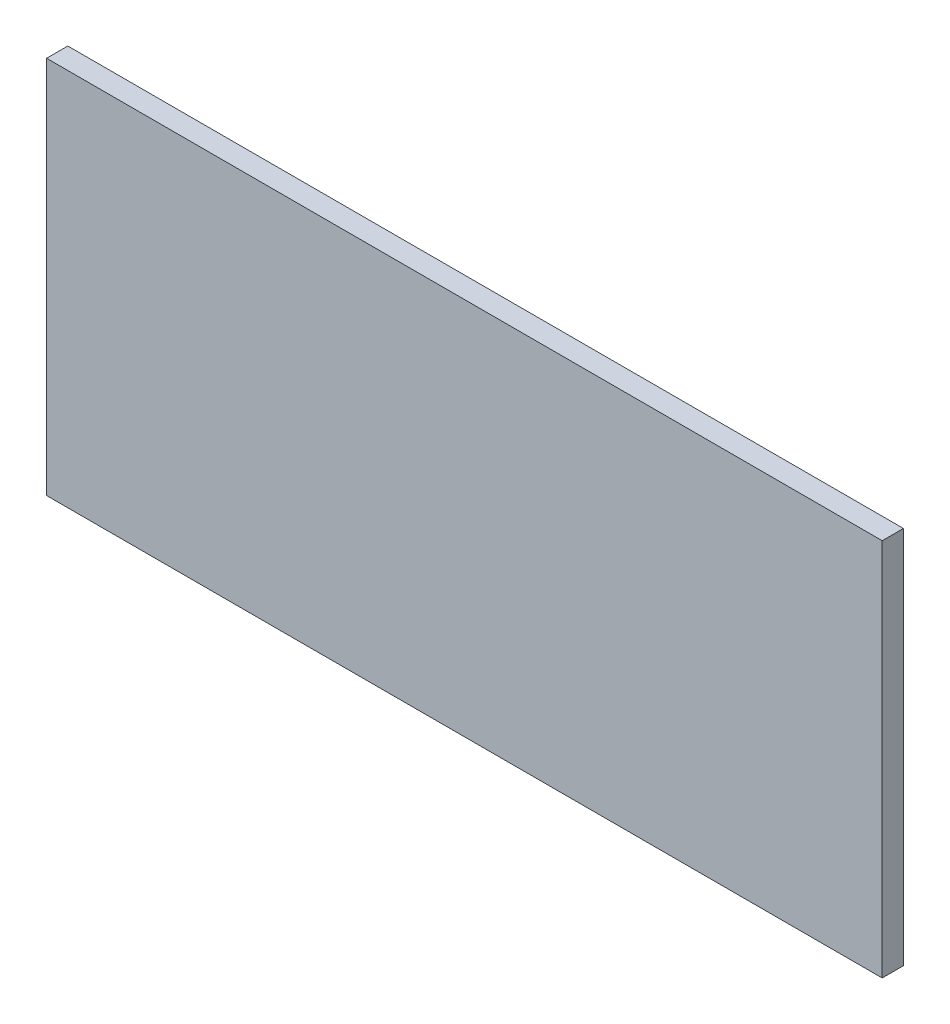
ISO-10303-21;
HEADER;
FILE_DESCRIPTION(('STEP AP214'),'2;1');
FILE_NAME('part.step','',(''),(''),'','','');
FILE_SCHEMA(('AUTOMOTIVE_DESIGN { 1 0 10303 214 1 1 1 1 }'));
ENDSEC;
DATA;
#1=APPLICATION_CONTEXT('core data for automotive mechanical design processes');
#2=APPLICATION_PROTOCOL_DEFINITION('international standard','automotive_design',2000,#1);
#3=PRODUCT_CONTEXT('',#1,'mechanical');
#4=PRODUCT('Part','Part','',(#3));
#5=PRODUCT_RELATED_PRODUCT_CATEGORY('part','',(#4));
#6=PRODUCT_DEFINITION_FORMATION('','',#4);
#7=PRODUCT_DEFINITION_CONTEXT('part definition',#1,'design');
#8=PRODUCT_DEFINITION('design','',#6,#7);
#9=PRODUCT_DEFINITION_SHAPE('','',#8);
#10=(LENGTH_UNIT() NAMED_UNIT(*) SI_UNIT(.MILLI.,.METRE.));
#11=(NAMED_UNIT(*) PLANE_ANGLE_UNIT() SI_UNIT($,.RADIAN.));
#12=(NAMED_UNIT(*) SI_UNIT($,.STERADIAN.) SOLID_ANGLE_UNIT());
#13=UNCERTAINTY_MEASURE_WITH_UNIT(LENGTH_MEASURE(1.E-05),#10,'distance_accuracy_value','');
#14=(GEOMETRIC_REPRESENTATION_CONTEXT(3) GLOBAL_UNCERTAINTY_ASSIGNED_CONTEXT((#13)) GLOBAL_UNIT_ASSIGNED_CONTEXT((#10,
#11,#12)) REPRESENTATION_CONTEXT('',''));
#15=CARTESIAN_POINT('',(0.,0.,0.));
#16=DIRECTION('',(0.,0.,1.));
#17=DIRECTION('',(1.,0.,0.));
#18=AXIS2_PLACEMENT_3D('',#15,#16,#17);
#19=CARTESIAN_POINT('',(-0.499999,0.22659848,0.));
#20=DIRECTION('',(1.,0.,0.));
#21=DIRECTION('',(0.,-1.,0.));
#22=AXIS2_PLACEMENT_3D('',#19,#20,#21);
#23=PLANE('',#22);
#24=DIRECTION('',(0.,-1.,0.));
#25=VECTOR('',#24,1.);
#26=CARTESIAN_POINT('',(-0.499999,0.22659848,0.));
#27=LINE('',#26,#25);
#28=CARTESIAN_POINT('',(-0.499999,0.22659848,0.));
#29=VERTEX_POINT('',#28);
#30=CARTESIAN_POINT('',(-0.499999,-0.22659848,0.));
#31=VERTEX_POINT('',#30);
#32=EDGE_CURVE('E11',#29,#31,#27,.T.);
#33=ORIENTED_EDGE('',*,*,#32,.T.);
#34=DIRECTION('',(0.,0.,1.));
#35=VECTOR('',#34,1.);
#36=CARTESIAN_POINT('',(-0.499999,-0.22659848,0.));
#37=LINE('',#36,#35);
#38=CARTESIAN_POINT('',(-0.499999,-0.22659848,0.0254));
#39=VERTEX_POINT('',#38);
#40=EDGE_CURVE('E24',#31,#39,#37,.T.);
#41=ORIENTED_EDGE('',*,*,#40,.T.);
#42=DIRECTION('',(0.,-1.,0.));
#43=VECTOR('',#42,1.);
#44=CARTESIAN_POINT('',(-0.499999,0.22659848,0.0254));
#45=LINE('',#44,#43);
#46=CARTESIAN_POINT('',(-0.499999,0.22659848,0.0254));
#47=VERTEX_POINT('',#46);
#48=EDGE_CURVE('E87',#47,#39,#45,.T.);
#49=ORIENTED_EDGE('',*,*,#48,.F.);
#50=DIRECTION('',(0.,0.,1.));
#51=VECTOR('',#50,1.);
#52=CARTESIAN_POINT('',(-0.499999,0.22659848,0.));
#53=LINE('',#52,#51);
#54=EDGE_CURVE('E36',#29,#47,#53,.T.);
#55=ORIENTED_EDGE('',*,*,#54,.F.);
#56=EDGE_LOOP('',(#33,#41,#49,#55));
#57=FACE_BOUND('',#56,.T.);
#58=ADVANCED_FACE('F17',(#57),#23,.F.);
#59=CARTESIAN_POINT('',(-0.499999,-0.22659848,0.));
#60=DIRECTION('',(0.,1.,0.));
#61=DIRECTION('',(1.,0.,0.));
#62=AXIS2_PLACEMENT_3D('',#59,#60,#61);
#63=PLANE('',#62);
#64=DIRECTION('',(1.,0.,0.));
#65=VECTOR('',#64,1.);
#66=CARTESIAN_POINT('',(-0.499999,-0.22659848,0.));
#67=LINE('',#66,#65);
#68=CARTESIAN_POINT('',(0.499999,-0.22659848,0.));
#69=VERTEX_POINT('',#68);
#70=EDGE_CURVE('E84',#31,#69,#67,.T.);
#71=ORIENTED_EDGE('',*,*,#70,.T.);
#72=DIRECTION('',(0.,0.,1.));
#73=VECTOR('',#72,1.);
#74=CARTESIAN_POINT('',(0.499999,-0.22659848,0.));
#75=LINE('',#74,#73);
#76=CARTESIAN_POINT('',(0.499999,-0.22659848,0.0254));
#77=VERTEX_POINT('',#76);
#78=EDGE_CURVE('E82',#69,#77,#75,.T.);
#79=ORIENTED_EDGE('',*,*,#78,.T.);
#80=DIRECTION('',(1.,0.,0.));
#81=VECTOR('',#80,1.);
#82=CARTESIAN_POINT('',(-0.499999,-0.22659848,0.0254));
#83=LINE('',#82,#81);
#84=EDGE_CURVE('E62',#39,#77,#83,.T.);
#85=ORIENTED_EDGE('',*,*,#84,.F.);
#86=ORIENTED_EDGE('',*,*,#40,.F.);
#87=EDGE_LOOP('',(#71,#79,#85,#86));
#88=FACE_BOUND('',#87,.T.);
#89=ADVANCED_FACE('F89',(#88),#63,.F.);
#90=CARTESIAN_POINT('',(0.499999,-0.22659848,0.));
#91=DIRECTION('',(-1.,0.,0.));
#92=DIRECTION('',(0.,1.,0.));
#93=AXIS2_PLACEMENT_3D('',#90,#91,#92);
#94=PLANE('',#93);
#95=DIRECTION('',(0.,1.,0.));
#96=VECTOR('',#95,1.);
#97=CARTESIAN_POINT('',(0.499999,-0.22659848,0.));
#98=LINE('',#97,#96);
#99=CARTESIAN_POINT('',(0.499999,0.22659848,0.));
#100=VERTEX_POINT('',#99);
#101=EDGE_CURVE('E71',#69,#100,#98,.T.);
#102=ORIENTED_EDGE('',*,*,#101,.T.);
#103=DIRECTION('',(0.,0.,1.));
#104=VECTOR('',#103,1.);
#105=CARTESIAN_POINT('',(0.499999,0.22659848,0.));
#106=LINE('',#105,#104);
#107=CARTESIAN_POINT('',(0.499999,0.22659848,0.0254));
#108=VERTEX_POINT('',#107);
#109=EDGE_CURVE('E65',#100,#108,#106,.T.);
#110=ORIENTED_EDGE('',*,*,#109,.T.);
#111=DIRECTION('',(0.,1.,0.));
#112=VECTOR('',#111,1.);
#113=CARTESIAN_POINT('',(0.499999,-0.22659848,0.0254));
#114=LINE('',#113,#112);
#115=EDGE_CURVE('E57',#77,#108,#114,.T.);
#116=ORIENTED_EDGE('',*,*,#115,.F.);
#117=ORIENTED_EDGE('',*,*,#78,.F.);
#118=EDGE_LOOP('',(#102,#110,#116,#117));
#119=FACE_BOUND('',#118,.T.);
#120=ADVANCED_FACE('F69',(#119),#94,.F.);
#121=CARTESIAN_POINT('',(0.499999,0.22659848,0.));
#122=DIRECTION('',(0.,-1.,0.));
#123=DIRECTION('',(-1.,0.,0.));
#124=AXIS2_PLACEMENT_3D('',#121,#122,#123);
#125=PLANE('',#124);
#126=DIRECTION('',(-1.,0.,0.));
#127=VECTOR('',#126,1.);
#128=CARTESIAN_POINT('',(0.499999,0.22659848,0.));
#129=LINE('',#128,#127);
#130=EDGE_CURVE('E66',#100,#29,#129,.T.);
#131=ORIENTED_EDGE('',*,*,#130,.T.);
#132=ORIENTED_EDGE('',*,*,#54,.T.);
#133=DIRECTION('',(-1.,0.,0.));
#134=VECTOR('',#133,1.);
#135=CARTESIAN_POINT('',(0.499999,0.22659848,0.0254));
#136=LINE('',#135,#134);
#137=EDGE_CURVE('E61',#108,#47,#136,.T.);
#138=ORIENTED_EDGE('',*,*,#137,.F.);
#139=ORIENTED_EDGE('',*,*,#109,.F.);
#140=EDGE_LOOP('',(#131,#132,#138,#139));
#141=FACE_BOUND('',#140,.T.);
#142=ADVANCED_FACE('F76',(#141),#125,.F.);
#143=CARTESIAN_POINT('',(-0.499999,0.22659848,0.));
#144=DIRECTION('',(0.,0.,-1.));
#145=DIRECTION('',(-1.,0.,0.));
#146=AXIS2_PLACEMENT_3D('',#143,#144,#145);
#147=PLANE('',#146);
#148=ORIENTED_EDGE('',*,*,#130,.F.);
#149=ORIENTED_EDGE('',*,*,#101,.F.);
#150=ORIENTED_EDGE('',*,*,#70,.F.);
#151=ORIENTED_EDGE('',*,*,#32,.F.);
#152=EDGE_LOOP('',(#148,#149,#150,#151));
#153=FACE_BOUND('',#152,.T.);
#154=ADVANCED_FACE('F91',(#153),#147,.T.);
#155=CARTESIAN_POINT('',(-0.499999,0.22659848,0.0254));
#156=DIRECTION('',(0.,0.,-1.));
#157=DIRECTION('',(-1.,0.,0.));
#158=AXIS2_PLACEMENT_3D('',#155,#156,#157);
#159=PLANE('',#158);
#160=ORIENTED_EDGE('',*,*,#48,.T.);
#161=ORIENTED_EDGE('',*,*,#84,.T.);
#162=ORIENTED_EDGE('',*,*,#115,.T.);
#163=ORIENTED_EDGE('',*,*,#137,.T.);
#164=EDGE_LOOP('',(#160,#161,#162,#163));
#165=FACE_BOUND('',#164,.T.);
#166=ADVANCED_FACE('F59',(#165),#159,.F.);
#167=CLOSED_SHELL('',(#58,#89,#120,#142,#154,#166));
#168=MANIFOLD_SOLID_BREP('B1',#167);
#169=ADVANCED_BREP_SHAPE_REPRESENTATION('',(#18,#168),#14);
#170=SHAPE_DEFINITION_REPRESENTATION(#9,#169);
ENDSEC;
END-ISO-10303-21;
